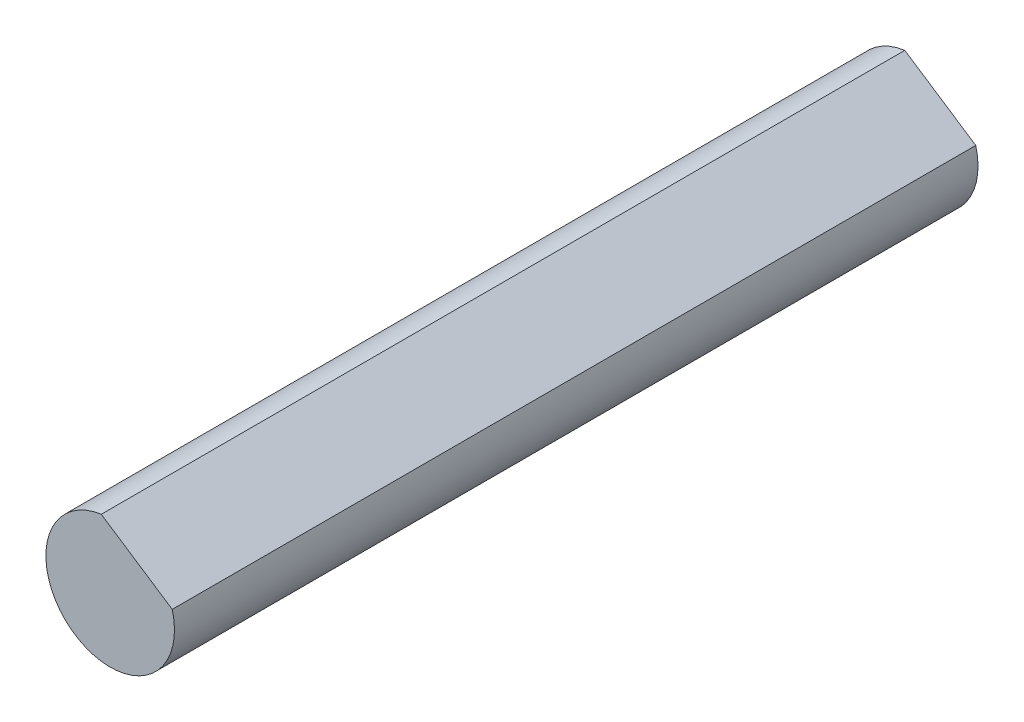
ISO-10303-21;
HEADER;
FILE_DESCRIPTION(('STEP AP214'),'2;1');
FILE_NAME('part.step','',(''),(''),'','','');
FILE_SCHEMA(('AUTOMOTIVE_DESIGN { 1 0 10303 214 1 1 1 1 }'));
ENDSEC;
DATA;
#1=APPLICATION_CONTEXT('core data for automotive mechanical design processes');
#2=APPLICATION_PROTOCOL_DEFINITION('international standard','automotive_design',2000,#1);
#3=PRODUCT_CONTEXT('',#1,'mechanical');
#4=PRODUCT('Part','Part','',(#3));
#5=PRODUCT_RELATED_PRODUCT_CATEGORY('part','',(#4));
#6=PRODUCT_DEFINITION_FORMATION('','',#4);
#7=PRODUCT_DEFINITION_CONTEXT('part definition',#1,'design');
#8=PRODUCT_DEFINITION('design','',#6,#7);
#9=PRODUCT_DEFINITION_SHAPE('','',#8);
#10=(LENGTH_UNIT() NAMED_UNIT(*) SI_UNIT(.MILLI.,.METRE.));
#11=(NAMED_UNIT(*) PLANE_ANGLE_UNIT() SI_UNIT($,.RADIAN.));
#12=(NAMED_UNIT(*) SI_UNIT($,.STERADIAN.) SOLID_ANGLE_UNIT());
#13=UNCERTAINTY_MEASURE_WITH_UNIT(LENGTH_MEASURE(1.E-05),#10,'distance_accuracy_value','');
#14=(GEOMETRIC_REPRESENTATION_CONTEXT(3) GLOBAL_UNCERTAINTY_ASSIGNED_CONTEXT((#13)) GLOBAL_UNIT_ASSIGNED_CONTEXT((#10,
#11,#12)) REPRESENTATION_CONTEXT('',''));
#15=CARTESIAN_POINT('',(0.,0.,0.));
#16=DIRECTION('',(0.,0.,1.));
#17=DIRECTION('',(1.,0.,0.));
#18=AXIS2_PLACEMENT_3D('',#15,#16,#17);
#19=CARTESIAN_POINT('',(0.,0.,25.));
#20=DIRECTION('',(0.,0.,-1.));
#21=DIRECTION('',(-1.,0.,0.));
#22=AXIS2_PLACEMENT_3D('',#19,#20,#21);
#23=CYLINDRICAL_SURFACE('',#22,2.);
#24=CARTESIAN_POINT('',(0.,0.,0.));
#25=DIRECTION('',(0.,0.,1.));
#26=DIRECTION('',(1.,0.,0.));
#27=AXIS2_PLACEMENT_3D('',#24,#25,#26);
#28=CIRCLE('',#27,2.);
#29=CARTESIAN_POINT('',(-0.277203518144222,1.9806963950915,0.));
#30=VERTEX_POINT('',#29);
#31=CARTESIAN_POINT('',(1.93051084178231,0.52261638872211,0.));
#32=VERTEX_POINT('',#31);
#33=EDGE_CURVE('E72',#30,#32,#28,.T.);
#34=ORIENTED_EDGE('',*,*,#33,.T.);
#35=DIRECTION('',(0.,0.,-1.));
#36=VECTOR('',#35,1.);
#37=CARTESIAN_POINT('',(1.93051084178231,0.52261638872211,25.));
#38=LINE('',#37,#36);
#39=CARTESIAN_POINT('',(1.93051084178231,0.52261638872211,25.));
#40=VERTEX_POINT('',#39);
#41=EDGE_CURVE('E11',#40,#32,#38,.T.);
#42=ORIENTED_EDGE('',*,*,#41,.F.);
#43=CARTESIAN_POINT('',(0.,0.,25.));
#44=DIRECTION('',(0.,0.,1.));
#45=DIRECTION('',(1.,0.,0.));
#46=AXIS2_PLACEMENT_3D('',#43,#44,#45);
#47=CIRCLE('',#46,2.);
#48=CARTESIAN_POINT('',(-0.277203518144222,1.9806963950915,25.));
#49=VERTEX_POINT('',#48);
#50=EDGE_CURVE('E71',#49,#40,#47,.T.);
#51=ORIENTED_EDGE('',*,*,#50,.F.);
#52=DIRECTION('',(0.,0.,-1.));
#53=VECTOR('',#52,1.);
#54=CARTESIAN_POINT('',(-0.277203518144222,1.9806963950915,25.));
#55=LINE('',#54,#53);
#56=EDGE_CURVE('E48',#49,#30,#55,.T.);
#57=ORIENTED_EDGE('',*,*,#56,.T.);
#58=EDGE_LOOP('',(#34,#42,#51,#57));
#59=FACE_BOUND('',#58,.T.);
#60=ADVANCED_FACE('F39',(#59),#23,.T.);
#61=CARTESIAN_POINT('',(-0.277203518144222,1.9806963950915,25.));
#62=DIRECTION('',(-0.551102441212698,-0.834437594604537,0.));
#63=DIRECTION('',(0.834437594604537,-0.551102441212698,0.));
#64=AXIS2_PLACEMENT_3D('',#61,#62,#63);
#65=PLANE('',#64);
#66=DIRECTION('',(-0.834437594604537,0.551102441212698,0.));
#67=VECTOR('',#66,1.);
#68=CARTESIAN_POINT('',(-0.277203518144222,1.9806963950915,0.));
#69=LINE('',#68,#67);
#70=EDGE_CURVE('E63',#32,#30,#69,.T.);
#71=ORIENTED_EDGE('',*,*,#70,.T.);
#72=ORIENTED_EDGE('',*,*,#56,.F.);
#73=DIRECTION('',(-0.834437594604537,0.551102441212698,0.));
#74=VECTOR('',#73,1.);
#75=CARTESIAN_POINT('',(-0.277203518144222,1.9806963950915,25.));
#76=LINE('',#75,#74);
#77=EDGE_CURVE('E55',#40,#49,#76,.T.);
#78=ORIENTED_EDGE('',*,*,#77,.F.);
#79=ORIENTED_EDGE('',*,*,#41,.T.);
#80=EDGE_LOOP('',(#71,#72,#78,#79));
#81=FACE_BOUND('',#80,.T.);
#82=ADVANCED_FACE('F66',(#81),#65,.F.);
#83=CARTESIAN_POINT('',(0.,0.,25.));
#84=DIRECTION('',(0.,0.,1.));
#85=DIRECTION('',(1.,0.,0.));
#86=AXIS2_PLACEMENT_3D('',#83,#84,#85);
#87=PLANE('',#86);
#88=ORIENTED_EDGE('',*,*,#50,.T.);
#89=ORIENTED_EDGE('',*,*,#77,.T.);
#90=EDGE_LOOP('',(#88,#89));
#91=FACE_BOUND('',#90,.T.);
#92=ADVANCED_FACE('F83',(#91),#87,.T.);
#93=CARTESIAN_POINT('',(0.,0.,0.));
#94=DIRECTION('',(0.,0.,1.));
#95=DIRECTION('',(1.,0.,0.));
#96=AXIS2_PLACEMENT_3D('',#93,#94,#95);
#97=PLANE('',#96);
#98=ORIENTED_EDGE('',*,*,#33,.F.);
#99=ORIENTED_EDGE('',*,*,#70,.F.);
#100=EDGE_LOOP('',(#98,#99));
#101=FACE_BOUND('',#100,.T.);
#102=ADVANCED_FACE('F76',(#101),#97,.F.);
#103=CLOSED_SHELL('',(#60,#82,#92,#102));
#104=MANIFOLD_SOLID_BREP('B2',#103);
#105=ADVANCED_BREP_SHAPE_REPRESENTATION('',(#18,#104),#14);
#106=SHAPE_DEFINITION_REPRESENTATION(#9,#105);
ENDSEC;
END-ISO-10303-21;
